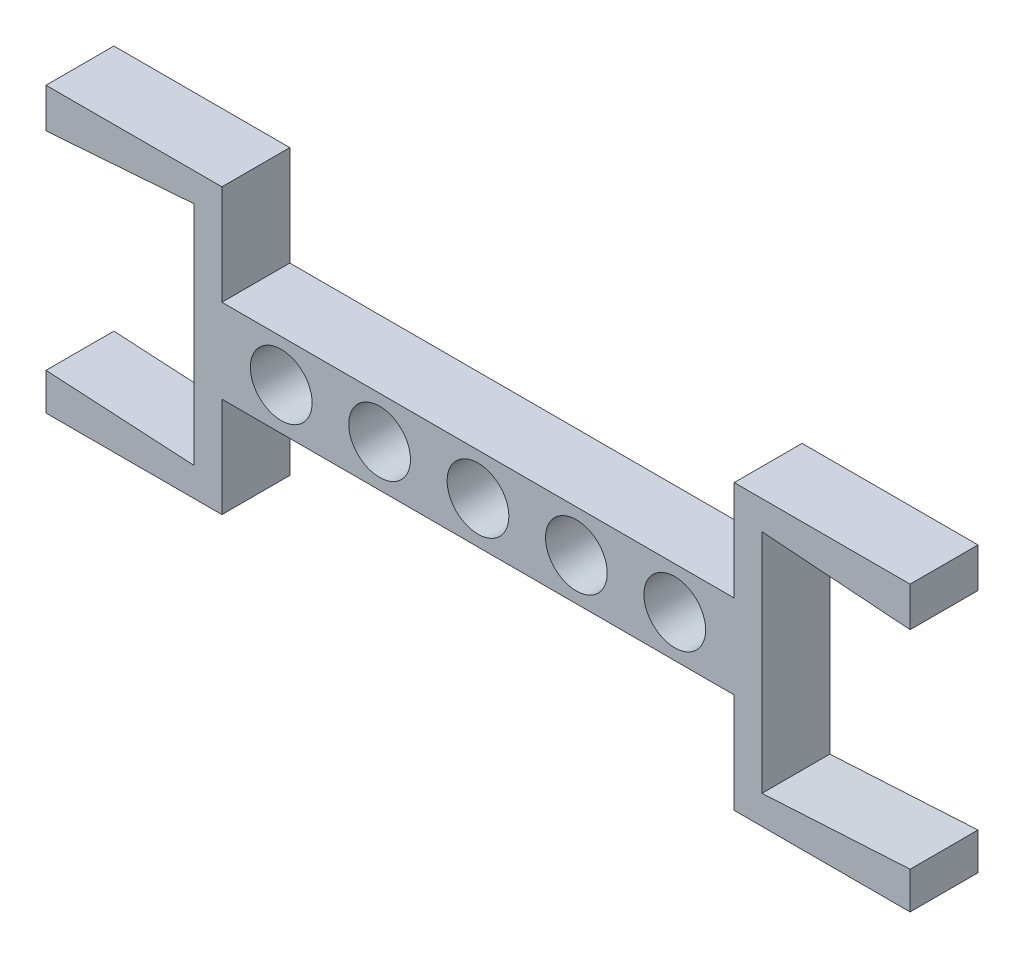
ISO-10303-21;
HEADER;
FILE_DESCRIPTION(('STEP AP214'),'2;1');
FILE_NAME('part.step','',(''),(''),'','','');
FILE_SCHEMA(('AUTOMOTIVE_DESIGN { 1 0 10303 214 1 1 1 1 }'));
ENDSEC;
DATA;
#1=APPLICATION_CONTEXT('core data for automotive mechanical design processes');
#2=APPLICATION_PROTOCOL_DEFINITION('international standard','automotive_design',2000,#1);
#3=PRODUCT_CONTEXT('',#1,'mechanical');
#4=PRODUCT('Part','Part','',(#3));
#5=PRODUCT_RELATED_PRODUCT_CATEGORY('part','',(#4));
#6=PRODUCT_DEFINITION_FORMATION('','',#4);
#7=PRODUCT_DEFINITION_CONTEXT('part definition',#1,'design');
#8=PRODUCT_DEFINITION('design','',#6,#7);
#9=PRODUCT_DEFINITION_SHAPE('','',#8);
#10=(LENGTH_UNIT() NAMED_UNIT(*) SI_UNIT(.MILLI.,.METRE.));
#11=(NAMED_UNIT(*) PLANE_ANGLE_UNIT() SI_UNIT($,.RADIAN.));
#12=(NAMED_UNIT(*) SI_UNIT($,.STERADIAN.) SOLID_ANGLE_UNIT());
#13=UNCERTAINTY_MEASURE_WITH_UNIT(LENGTH_MEASURE(1.E-05),#10,'distance_accuracy_value','');
#14=(GEOMETRIC_REPRESENTATION_CONTEXT(3) GLOBAL_UNCERTAINTY_ASSIGNED_CONTEXT((#13)) GLOBAL_UNIT_ASSIGNED_CONTEXT((#10,
#11,#12)) REPRESENTATION_CONTEXT('',''));
#15=CARTESIAN_POINT('',(0.,0.,0.));
#16=DIRECTION('',(0.,0.,1.));
#17=DIRECTION('',(1.,0.,0.));
#18=AXIS2_PLACEMENT_3D('',#15,#16,#17);
#19=CARTESIAN_POINT('',(0.,-33.6920523654957,5.5));
#20=DIRECTION('',(0.,-1.,0.));
#21=DIRECTION('',(0.,0.,-1.));
#22=AXIS2_PLACEMENT_3D('',#19,#20,#21);
#23=PLANE('',#22);
#24=DIRECTION('',(-1.,0.,0.));
#25=VECTOR('',#24,1.);
#26=CARTESIAN_POINT('',(0.,-33.6920523654957,0.));
#27=LINE('',#26,#25);
#28=CARTESIAN_POINT('',(-15.2191397554439,-33.6920523654957,0.));
#29=VERTEX_POINT('',#28);
#30=CARTESIAN_POINT('',(-29.4691397554439,-33.6920523654957,0.));
#31=VERTEX_POINT('',#30);
#32=EDGE_CURVE('E309',#29,#31,#27,.T.);
#33=ORIENTED_EDGE('',*,*,#32,.T.);
#34=DIRECTION('',(0.,0.,-1.));
#35=VECTOR('',#34,1.);
#36=CARTESIAN_POINT('',(-29.4691397554439,-33.6920523654957,5.5));
#37=LINE('',#36,#35);
#38=CARTESIAN_POINT('',(-29.4691397554439,-33.6920523654957,5.5));
#39=VERTEX_POINT('',#38);
#40=EDGE_CURVE('E121',#39,#31,#37,.T.);
#41=ORIENTED_EDGE('',*,*,#40,.F.);
#42=DIRECTION('',(-1.,0.,0.));
#43=VECTOR('',#42,1.);
#44=CARTESIAN_POINT('',(0.,-33.6920523654957,5.5));
#45=LINE('',#44,#43);
#46=CARTESIAN_POINT('',(-15.2191397554439,-33.6920523654957,5.5));
#47=VERTEX_POINT('',#46);
#48=EDGE_CURVE('E373',#47,#39,#45,.T.);
#49=ORIENTED_EDGE('',*,*,#48,.F.);
#50=DIRECTION('',(0.,0.,-1.));
#51=VECTOR('',#50,1.);
#52=CARTESIAN_POINT('',(-15.2191397554439,-33.6920523654957,5.5));
#53=LINE('',#52,#51);
#54=EDGE_CURVE('E12',#47,#29,#53,.T.);
#55=ORIENTED_EDGE('',*,*,#54,.T.);
#56=EDGE_LOOP('',(#33,#41,#49,#55));
#57=FACE_BOUND('',#56,.T.);
#58=ADVANCED_FACE('F111',(#57),#23,.F.);
#59=CARTESIAN_POINT('',(-29.4691397554438,1.36322156134959E-13,5.5));
#60=DIRECTION('',(-1.,0.,0.));
#61=DIRECTION('',(0.,-1.,0.));
#62=AXIS2_PLACEMENT_3D('',#59,#60,#61);
#63=PLANE('',#62);
#64=DIRECTION('',(0.,1.,0.));
#65=VECTOR('',#64,1.);
#66=CARTESIAN_POINT('',(-29.4691397554438,1.36322156134959E-13,0.));
#67=LINE('',#66,#65);
#68=CARTESIAN_POINT('',(-29.4691397554439,-41.7920523654957,0.));
#69=VERTEX_POINT('',#68);
#70=EDGE_CURVE('E306',#69,#31,#67,.T.);
#71=ORIENTED_EDGE('',*,*,#70,.F.);
#72=DIRECTION('',(0.,0.,-1.));
#73=VECTOR('',#72,1.);
#74=CARTESIAN_POINT('',(-29.4691397554439,-41.7920523654957,5.5));
#75=LINE('',#74,#73);
#76=CARTESIAN_POINT('',(-29.4691397554439,-41.7920523654957,5.5));
#77=VERTEX_POINT('',#76);
#78=EDGE_CURVE('E233',#77,#69,#75,.T.);
#79=ORIENTED_EDGE('',*,*,#78,.F.);
#80=DIRECTION('',(0.,1.,0.));
#81=VECTOR('',#80,1.);
#82=CARTESIAN_POINT('',(-29.4691397554438,1.36322156134959E-13,5.5));
#83=LINE('',#82,#81);
#84=EDGE_CURVE('E370',#77,#39,#83,.T.);
#85=ORIENTED_EDGE('',*,*,#84,.T.);
#86=ORIENTED_EDGE('',*,*,#40,.T.);
#87=EDGE_LOOP('',(#71,#79,#85,#86));
#88=FACE_BOUND('',#87,.T.);
#89=ADVANCED_FACE('F427',(#88),#63,.T.);
#90=CARTESIAN_POINT('',(0.,-41.7920523654957,5.5));
#91=DIRECTION('',(0.,1.,0.));
#92=DIRECTION('',(0.,0.,1.));
#93=AXIS2_PLACEMENT_3D('',#90,#91,#92);
#94=PLANE('',#93);
#95=DIRECTION('',(1.,0.,0.));
#96=VECTOR('',#95,1.);
#97=CARTESIAN_POINT('',(0.,-41.7920523654957,0.));
#98=LINE('',#97,#96);
#99=CARTESIAN_POINT('',(-70.969139755444,-41.7920523654957,0.));
#100=VERTEX_POINT('',#99);
#101=EDGE_CURVE('E303',#100,#69,#98,.T.);
#102=ORIENTED_EDGE('',*,*,#101,.F.);
#103=DIRECTION('',(0.,0.,-1.));
#104=VECTOR('',#103,1.);
#105=CARTESIAN_POINT('',(-70.969139755444,-41.7920523654957,5.5));
#106=LINE('',#105,#104);
#107=CARTESIAN_POINT('',(-70.969139755444,-41.7920523654957,5.5));
#108=VERTEX_POINT('',#107);
#109=EDGE_CURVE('E235',#108,#100,#106,.T.);
#110=ORIENTED_EDGE('',*,*,#109,.F.);
#111=DIRECTION('',(1.,0.,0.));
#112=VECTOR('',#111,1.);
#113=CARTESIAN_POINT('',(0.,-41.7920523654957,5.5));
#114=LINE('',#113,#112);
#115=EDGE_CURVE('E367',#108,#77,#114,.T.);
#116=ORIENTED_EDGE('',*,*,#115,.T.);
#117=ORIENTED_EDGE('',*,*,#78,.T.);
#118=EDGE_LOOP('',(#102,#110,#116,#117));
#119=FACE_BOUND('',#118,.T.);
#120=ADVANCED_FACE('F434',(#119),#94,.T.);
#121=CARTESIAN_POINT('',(-70.969139755444,0.,5.5));
#122=DIRECTION('',(1.,0.,0.));
#123=DIRECTION('',(0.,0.,-1.));
#124=AXIS2_PLACEMENT_3D('',#121,#122,#123);
#125=PLANE('',#124);
#126=DIRECTION('',(0.,-1.,0.));
#127=VECTOR('',#126,1.);
#128=CARTESIAN_POINT('',(-70.969139755444,0.,0.));
#129=LINE('',#128,#127);
#130=CARTESIAN_POINT('',(-70.969139755444,-33.6920523654957,0.));
#131=VERTEX_POINT('',#130);
#132=EDGE_CURVE('E200',#131,#100,#129,.T.);
#133=ORIENTED_EDGE('',*,*,#132,.F.);
#134=DIRECTION('',(0.,0.,-1.));
#135=VECTOR('',#134,1.);
#136=CARTESIAN_POINT('',(-70.969139755444,-33.6920523654957,5.5));
#137=LINE('',#136,#135);
#138=CARTESIAN_POINT('',(-70.969139755444,-33.6920523654957,5.5));
#139=VERTEX_POINT('',#138);
#140=EDGE_CURVE('E115',#139,#131,#137,.T.);
#141=ORIENTED_EDGE('',*,*,#140,.F.);
#142=DIRECTION('',(0.,-1.,0.));
#143=VECTOR('',#142,1.);
#144=CARTESIAN_POINT('',(-70.969139755444,0.,5.5));
#145=LINE('',#144,#143);
#146=EDGE_CURVE('E364',#139,#108,#145,.T.);
#147=ORIENTED_EDGE('',*,*,#146,.T.);
#148=ORIENTED_EDGE('',*,*,#109,.T.);
#149=EDGE_LOOP('',(#133,#141,#147,#148));
#150=FACE_BOUND('',#149,.T.);
#151=ADVANCED_FACE('F437',(#150),#125,.T.);
#152=CARTESIAN_POINT('',(-85.219139755444,0.,5.5));
#153=DIRECTION('',(1.,0.,0.));
#154=DIRECTION('',(0.,0.,-1.));
#155=AXIS2_PLACEMENT_3D('',#152,#153,#154);
#156=PLANE('',#155);
#157=DIRECTION('',(0.,-1.,0.));
#158=VECTOR('',#157,1.);
#159=CARTESIAN_POINT('',(-85.219139755444,0.,0.));
#160=LINE('',#159,#158);
#161=CARTESIAN_POINT('',(-85.219139755444,-33.6920523654957,0.));
#162=VERTEX_POINT('',#161);
#163=CARTESIAN_POINT('',(-85.219139755444,-36.8920523654957,0.));
#164=VERTEX_POINT('',#163);
#165=EDGE_CURVE('E206',#162,#164,#160,.T.);
#166=ORIENTED_EDGE('',*,*,#165,.T.);
#167=DIRECTION('',(0.,0.,-1.));
#168=VECTOR('',#167,1.);
#169=CARTESIAN_POINT('',(-85.219139755444,-36.8920523654957,5.5));
#170=LINE('',#169,#168);
#171=CARTESIAN_POINT('',(-85.219139755444,-36.8920523654957,5.5));
#172=VERTEX_POINT('',#171);
#173=EDGE_CURVE('E237',#172,#164,#170,.T.);
#174=ORIENTED_EDGE('',*,*,#173,.F.);
#175=DIRECTION('',(0.,-1.,0.));
#176=VECTOR('',#175,1.);
#177=CARTESIAN_POINT('',(-85.219139755444,0.,5.5));
#178=LINE('',#177,#176);
#179=CARTESIAN_POINT('',(-85.219139755444,-33.6920523654957,5.5));
#180=VERTEX_POINT('',#179);
#181=EDGE_CURVE('E223',#180,#172,#178,.T.);
#182=ORIENTED_EDGE('',*,*,#181,.F.);
#183=DIRECTION('',(0.,0.,-1.));
#184=VECTOR('',#183,1.);
#185=CARTESIAN_POINT('',(-85.219139755444,-33.6920523654957,5.5));
#186=LINE('',#185,#184);
#187=EDGE_CURVE('E220',#180,#162,#186,.T.);
#188=ORIENTED_EDGE('',*,*,#187,.T.);
#189=EDGE_LOOP('',(#166,#174,#182,#188));
#190=FACE_BOUND('',#189,.T.);
#191=ADVANCED_FACE('F221',(#190),#156,.F.);
#192=CARTESIAN_POINT('',(2.22997388961368,-30.4978576550296,5.5));
#193=DIRECTION('',(-0.0729243526956675,0.99733747487193,0.));
#194=DIRECTION('',(-0.99733747487193,-0.0729243526956675,0.));
#195=AXIS2_PLACEMENT_3D('',#192,#193,#194);
#196=PLANE('',#195);
#197=DIRECTION('',(0.99733747487193,0.0729243526956675,0.));
#198=VECTOR('',#197,1.);
#199=CARTESIAN_POINT('',(2.22997388961368,-30.4978576550296,0.));
#200=LINE('',#199,#198);
#201=CARTESIAN_POINT('',(-73.2163421258765,-36.0144193979932,0.));
#202=VERTEX_POINT('',#201);
#203=EDGE_CURVE('E213',#164,#202,#200,.T.);
#204=ORIENTED_EDGE('',*,*,#203,.T.);
#205=DIRECTION('',(0.,0.,-1.));
#206=VECTOR('',#205,1.);
#207=CARTESIAN_POINT('',(-73.2163421258765,-36.0144193979932,5.5));
#208=LINE('',#207,#206);
#209=CARTESIAN_POINT('',(-73.2163421258765,-36.0144193979932,5.5));
#210=VERTEX_POINT('',#209);
#211=EDGE_CURVE('E239',#210,#202,#208,.T.);
#212=ORIENTED_EDGE('',*,*,#211,.F.);
#213=DIRECTION('',(0.99733747487193,0.0729243526956675,0.));
#214=VECTOR('',#213,1.);
#215=CARTESIAN_POINT('',(2.22997388961368,-30.4978576550296,5.5));
#216=LINE('',#215,#214);
#217=EDGE_CURVE('E360',#172,#210,#216,.T.);
#218=ORIENTED_EDGE('',*,*,#217,.F.);
#219=ORIENTED_EDGE('',*,*,#173,.T.);
#220=EDGE_LOOP('',(#204,#212,#218,#219));
#221=FACE_BOUND('',#220,.T.);
#222=ADVANCED_FACE('F443',(#221),#196,.F.);
#223=CARTESIAN_POINT('',(-73.2163421258765,0.,5.5));
#224=DIRECTION('',(1.,0.,0.));
#225=DIRECTION('',(0.,0.,-1.));
#226=AXIS2_PLACEMENT_3D('',#223,#224,#225);
#227=PLANE('',#226);
#228=DIRECTION('',(0.,-1.,0.));
#229=VECTOR('',#228,1.);
#230=CARTESIAN_POINT('',(-73.2163421258765,0.,0.));
#231=LINE('',#230,#229);
#232=CARTESIAN_POINT('',(-73.2163421258765,-54.3696853329982,0.));
#233=VERTEX_POINT('',#232);
#234=EDGE_CURVE('E298',#202,#233,#231,.T.);
#235=ORIENTED_EDGE('',*,*,#234,.T.);
#236=DIRECTION('',(0.,0.,-1.));
#237=VECTOR('',#236,1.);
#238=CARTESIAN_POINT('',(-73.2163421258765,-54.3696853329982,5.5));
#239=LINE('',#238,#237);
#240=CARTESIAN_POINT('',(-73.2163421258765,-54.3696853329982,5.5));
#241=VERTEX_POINT('',#240);
#242=EDGE_CURVE('E242',#241,#233,#239,.T.);
#243=ORIENTED_EDGE('',*,*,#242,.F.);
#244=DIRECTION('',(0.,-1.,0.));
#245=VECTOR('',#244,1.);
#246=CARTESIAN_POINT('',(-73.2163421258765,0.,5.5));
#247=LINE('',#246,#245);
#248=EDGE_CURVE('E357',#210,#241,#247,.T.);
#249=ORIENTED_EDGE('',*,*,#248,.F.);
#250=ORIENTED_EDGE('',*,*,#211,.T.);
#251=EDGE_LOOP('',(#235,#243,#249,#250));
#252=FACE_BOUND('',#251,.T.);
#253=ADVANCED_FACE('F448',(#252),#227,.F.);
#254=CARTESIAN_POINT('',(-3.29237789325316,-58.3173302775208,5.5));
#255=DIRECTION('',(0.0563664947485583,0.998410145315922,0.));
#256=DIRECTION('',(-0.998410145315922,0.0563664947485583,0.));
#257=AXIS2_PLACEMENT_3D('',#254,#255,#256);
#258=PLANE('',#257);
#259=DIRECTION('',(0.998410145315922,-0.0563664947485583,0.));
#260=VECTOR('',#259,1.);
#261=CARTESIAN_POINT('',(-3.29237789325316,-58.3173302775208,0.));
#262=LINE('',#261,#260);
#263=CARTESIAN_POINT('',(-85.219139755444,-53.6920523654957,0.));
#264=VERTEX_POINT('',#263);
#265=EDGE_CURVE('E295',#264,#233,#262,.T.);
#266=ORIENTED_EDGE('',*,*,#265,.F.);
#267=DIRECTION('',(0.,0.,-1.));
#268=VECTOR('',#267,1.);
#269=CARTESIAN_POINT('',(-85.219139755444,-53.6920523654957,5.5));
#270=LINE('',#269,#268);
#271=CARTESIAN_POINT('',(-85.219139755444,-53.6920523654957,5.5));
#272=VERTEX_POINT('',#271);
#273=EDGE_CURVE('E244',#272,#264,#270,.T.);
#274=ORIENTED_EDGE('',*,*,#273,.F.);
#275=DIRECTION('',(0.998410145315922,-0.0563664947485583,0.));
#276=VECTOR('',#275,1.);
#277=CARTESIAN_POINT('',(-3.29237789325316,-58.3173302775208,5.5));
#278=LINE('',#277,#276);
#279=EDGE_CURVE('E354',#272,#241,#278,.T.);
#280=ORIENTED_EDGE('',*,*,#279,.T.);
#281=ORIENTED_EDGE('',*,*,#242,.T.);
#282=EDGE_LOOP('',(#266,#274,#280,#281));
#283=FACE_BOUND('',#282,.T.);
#284=ADVANCED_FACE('F515',(#283),#258,.T.);
#285=CARTESIAN_POINT('',(-85.219139755444,-56.6920523654957,0.));
#286=VERTEX_POINT('',#285);
#287=EDGE_CURVE('E218',#264,#286,#160,.T.);
#288=ORIENTED_EDGE('',*,*,#287,.T.);
#289=DIRECTION('',(0.,0.,-1.));
#290=VECTOR('',#289,1.);
#291=CARTESIAN_POINT('',(-85.219139755444,-56.6920523654957,5.5));
#292=LINE('',#291,#290);
#293=CARTESIAN_POINT('',(-85.219139755444,-56.6920523654957,5.5));
#294=VERTEX_POINT('',#293);
#295=EDGE_CURVE('E246',#294,#286,#292,.T.);
#296=ORIENTED_EDGE('',*,*,#295,.F.);
#297=EDGE_CURVE('E353',#272,#294,#178,.T.);
#298=ORIENTED_EDGE('',*,*,#297,.F.);
#299=ORIENTED_EDGE('',*,*,#273,.T.);
#300=EDGE_LOOP('',(#288,#296,#298,#299));
#301=FACE_BOUND('',#300,.T.);
#302=ADVANCED_FACE('F513',(#301),#156,.F.);
#303=CARTESIAN_POINT('',(0.,-56.6920523654957,5.5));
#304=DIRECTION('',(0.,1.,0.));
#305=DIRECTION('',(0.,0.,1.));
#306=AXIS2_PLACEMENT_3D('',#303,#304,#305);
#307=PLANE('',#306);
#308=DIRECTION('',(1.,0.,0.));
#309=VECTOR('',#308,1.);
#310=CARTESIAN_POINT('',(0.,-56.6920523654957,0.));
#311=LINE('',#310,#309);
#312=CARTESIAN_POINT('',(-70.969139755444,-56.6920523654957,0.));
#313=VERTEX_POINT('',#312);
#314=EDGE_CURVE('E292',#286,#313,#311,.T.);
#315=ORIENTED_EDGE('',*,*,#314,.T.);
#316=DIRECTION('',(0.,0.,-1.));
#317=VECTOR('',#316,1.);
#318=CARTESIAN_POINT('',(-70.969139755444,-56.6920523654957,5.5));
#319=LINE('',#318,#317);
#320=CARTESIAN_POINT('',(-70.969139755444,-56.6920523654957,5.5));
#321=VERTEX_POINT('',#320);
#322=EDGE_CURVE('E249',#321,#313,#319,.T.);
#323=ORIENTED_EDGE('',*,*,#322,.F.);
#324=DIRECTION('',(1.,0.,0.));
#325=VECTOR('',#324,1.);
#326=CARTESIAN_POINT('',(0.,-56.6920523654957,5.5));
#327=LINE('',#326,#325);
#328=EDGE_CURVE('E350',#294,#321,#327,.T.);
#329=ORIENTED_EDGE('',*,*,#328,.F.);
#330=ORIENTED_EDGE('',*,*,#295,.T.);
#331=EDGE_LOOP('',(#315,#323,#329,#330));
#332=FACE_BOUND('',#331,.T.);
#333=ADVANCED_FACE('F510',(#332),#307,.F.);
#334=CARTESIAN_POINT('',(-70.969139755444,0.,5.5));
#335=DIRECTION('',(1.,0.,0.));
#336=DIRECTION('',(0.,0.,-1.));
#337=AXIS2_PLACEMENT_3D('',#334,#335,#336);
#338=PLANE('',#337);
#339=DIRECTION('',(0.,-1.,0.));
#340=VECTOR('',#339,1.);
#341=CARTESIAN_POINT('',(-70.969139755444,0.,0.));
#342=LINE('',#341,#340);
#343=CARTESIAN_POINT('',(-70.969139755444,-48.5920523654957,0.));
#344=VERTEX_POINT('',#343);
#345=EDGE_CURVE('E289',#344,#313,#342,.T.);
#346=ORIENTED_EDGE('',*,*,#345,.F.);
#347=DIRECTION('',(0.,0.,-1.));
#348=VECTOR('',#347,1.);
#349=CARTESIAN_POINT('',(-70.969139755444,-48.5920523654957,5.5));
#350=LINE('',#349,#348);
#351=CARTESIAN_POINT('',(-70.969139755444,-48.5920523654957,5.5));
#352=VERTEX_POINT('',#351);
#353=EDGE_CURVE('E251',#352,#344,#350,.T.);
#354=ORIENTED_EDGE('',*,*,#353,.F.);
#355=DIRECTION('',(0.,-1.,0.));
#356=VECTOR('',#355,1.);
#357=CARTESIAN_POINT('',(-70.969139755444,0.,5.5));
#358=LINE('',#357,#356);
#359=EDGE_CURVE('E347',#352,#321,#358,.T.);
#360=ORIENTED_EDGE('',*,*,#359,.T.);
#361=ORIENTED_EDGE('',*,*,#322,.T.);
#362=EDGE_LOOP('',(#346,#354,#360,#361));
#363=FACE_BOUND('',#362,.T.);
#364=ADVANCED_FACE('F503',(#363),#338,.T.);
#365=CARTESIAN_POINT('',(0.,-48.5920523654957,5.5));
#366=DIRECTION('',(0.,-1.,0.));
#367=DIRECTION('',(0.,0.,-1.));
#368=AXIS2_PLACEMENT_3D('',#365,#366,#367);
#369=PLANE('',#368);
#370=DIRECTION('',(-1.,0.,0.));
#371=VECTOR('',#370,1.);
#372=CARTESIAN_POINT('',(0.,-48.5920523654957,0.));
#373=LINE('',#372,#371);
#374=CARTESIAN_POINT('',(-29.4691397554439,-48.5920523654957,0.));
#375=VERTEX_POINT('',#374);
#376=EDGE_CURVE('E286',#375,#344,#373,.T.);
#377=ORIENTED_EDGE('',*,*,#376,.F.);
#378=DIRECTION('',(0.,0.,-1.));
#379=VECTOR('',#378,1.);
#380=CARTESIAN_POINT('',(-29.4691397554439,-48.5920523654957,5.5));
#381=LINE('',#380,#379);
#382=CARTESIAN_POINT('',(-29.4691397554439,-48.5920523654957,5.5));
#383=VERTEX_POINT('',#382);
#384=EDGE_CURVE('E253',#383,#375,#381,.T.);
#385=ORIENTED_EDGE('',*,*,#384,.F.);
#386=DIRECTION('',(-1.,0.,0.));
#387=VECTOR('',#386,1.);
#388=CARTESIAN_POINT('',(0.,-48.5920523654957,5.5));
#389=LINE('',#388,#387);
#390=EDGE_CURVE('E344',#383,#352,#389,.T.);
#391=ORIENTED_EDGE('',*,*,#390,.T.);
#392=ORIENTED_EDGE('',*,*,#353,.T.);
#393=EDGE_LOOP('',(#377,#385,#391,#392));
#394=FACE_BOUND('',#393,.T.);
#395=ADVANCED_FACE('F497',(#394),#369,.T.);
#396=CARTESIAN_POINT('',(-29.4691397554439,0.,5.5));
#397=DIRECTION('',(1.,0.,0.));
#398=DIRECTION('',(0.,0.,-1.));
#399=AXIS2_PLACEMENT_3D('',#396,#397,#398);
#400=PLANE('',#399);
#401=DIRECTION('',(0.,-1.,0.));
#402=VECTOR('',#401,1.);
#403=CARTESIAN_POINT('',(-29.4691397554439,0.,0.));
#404=LINE('',#403,#402);
#405=CARTESIAN_POINT('',(-29.4691397554439,-56.6920523654957,0.));
#406=VERTEX_POINT('',#405);
#407=EDGE_CURVE('E283',#375,#406,#404,.T.);
#408=ORIENTED_EDGE('',*,*,#407,.T.);
#409=DIRECTION('',(0.,0.,-1.));
#410=VECTOR('',#409,1.);
#411=CARTESIAN_POINT('',(-29.4691397554439,-56.6920523654957,5.5));
#412=LINE('',#411,#410);
#413=CARTESIAN_POINT('',(-29.4691397554439,-56.6920523654957,5.5));
#414=VERTEX_POINT('',#413);
#415=EDGE_CURVE('E255',#414,#406,#412,.T.);
#416=ORIENTED_EDGE('',*,*,#415,.F.);
#417=DIRECTION('',(0.,-1.,0.));
#418=VECTOR('',#417,1.);
#419=CARTESIAN_POINT('',(-29.4691397554439,0.,5.5));
#420=LINE('',#419,#418);
#421=EDGE_CURVE('E341',#383,#414,#420,.T.);
#422=ORIENTED_EDGE('',*,*,#421,.F.);
#423=ORIENTED_EDGE('',*,*,#384,.T.);
#424=EDGE_LOOP('',(#408,#416,#422,#423));
#425=FACE_BOUND('',#424,.T.);
#426=ADVANCED_FACE('F569',(#425),#400,.F.);
#427=CARTESIAN_POINT('',(0.,-56.6920523654957,5.5));
#428=DIRECTION('',(0.,-1.,0.));
#429=DIRECTION('',(0.,0.,-1.));
#430=AXIS2_PLACEMENT_3D('',#427,#428,#429);
#431=PLANE('',#430);
#432=DIRECTION('',(-1.,0.,0.));
#433=VECTOR('',#432,1.);
#434=CARTESIAN_POINT('',(0.,-56.6920523654957,0.));
#435=LINE('',#434,#433);
#436=CARTESIAN_POINT('',(-15.2191397554439,-56.6920523654957,0.));
#437=VERTEX_POINT('',#436);
#438=EDGE_CURVE('E280',#437,#406,#435,.T.);
#439=ORIENTED_EDGE('',*,*,#438,.F.);
#440=DIRECTION('',(0.,0.,-1.));
#441=VECTOR('',#440,1.);
#442=CARTESIAN_POINT('',(-15.2191397554439,-56.6920523654957,5.5));
#443=LINE('',#442,#441);
#444=CARTESIAN_POINT('',(-15.2191397554439,-56.6920523654957,5.5));
#445=VERTEX_POINT('',#444);
#446=EDGE_CURVE('E257',#445,#437,#443,.T.);
#447=ORIENTED_EDGE('',*,*,#446,.F.);
#448=DIRECTION('',(-1.,0.,0.));
#449=VECTOR('',#448,1.);
#450=CARTESIAN_POINT('',(0.,-56.6920523654957,5.5));
#451=LINE('',#450,#449);
#452=EDGE_CURVE('E338',#445,#414,#451,.T.);
#453=ORIENTED_EDGE('',*,*,#452,.T.);
#454=ORIENTED_EDGE('',*,*,#415,.T.);
#455=EDGE_LOOP('',(#439,#447,#453,#454));
#456=FACE_BOUND('',#455,.T.);
#457=ADVANCED_FACE('F491',(#456),#431,.T.);
#458=CARTESIAN_POINT('',(-15.2191397554439,0.,5.5));
#459=DIRECTION('',(1.,0.,0.));
#460=DIRECTION('',(0.,0.,-1.));
#461=AXIS2_PLACEMENT_3D('',#458,#459,#460);
#462=PLANE('',#461);
#463=DIRECTION('',(0.,-1.,0.));
#464=VECTOR('',#463,1.);
#465=CARTESIAN_POINT('',(-15.2191397554439,0.,0.));
#466=LINE('',#465,#464);
#467=CARTESIAN_POINT('',(-15.219139755444,-53.6920523654957,0.));
#468=VERTEX_POINT('',#467);
#469=EDGE_CURVE('E277',#468,#437,#466,.T.);
#470=ORIENTED_EDGE('',*,*,#469,.F.);
#471=DIRECTION('',(0.,0.,-1.));
#472=VECTOR('',#471,1.);
#473=CARTESIAN_POINT('',(-15.219139755444,-53.6920523654957,5.5));
#474=LINE('',#473,#472);
#475=CARTESIAN_POINT('',(-15.219139755444,-53.6920523654957,5.5));
#476=VERTEX_POINT('',#475);
#477=EDGE_CURVE('E259',#476,#468,#474,.T.);
#478=ORIENTED_EDGE('',*,*,#477,.F.);
#479=DIRECTION('',(0.,-1.,0.));
#480=VECTOR('',#479,1.);
#481=CARTESIAN_POINT('',(-15.2191397554439,0.,5.5));
#482=LINE('',#481,#480);
#483=EDGE_CURVE('E335',#476,#445,#482,.T.);
#484=ORIENTED_EDGE('',*,*,#483,.T.);
#485=ORIENTED_EDGE('',*,*,#446,.T.);
#486=EDGE_LOOP('',(#470,#478,#484,#485));
#487=FACE_BOUND('',#486,.T.);
#488=ADVANCED_FACE('F488',(#487),#462,.T.);
#489=CARTESIAN_POINT('',(2.9732672265745,-52.6649772527011,5.5));
#490=DIRECTION('',(0.0563664947485583,-0.998410145315922,0.));
#491=DIRECTION('',(0.998410145315922,0.0563664947485583,0.));
#492=AXIS2_PLACEMENT_3D('',#489,#490,#491);
#493=PLANE('',#492);
#494=DIRECTION('',(-0.998410145315922,-0.0563664947485583,0.));
#495=VECTOR('',#494,1.);
#496=CARTESIAN_POINT('',(2.9732672265745,-52.6649772527011,0.));
#497=LINE('',#496,#495);
#498=CARTESIAN_POINT('',(-27.2219373850114,-54.3696853329982,0.));
#499=VERTEX_POINT('',#498);
#500=EDGE_CURVE('E274',#468,#499,#497,.T.);
#501=ORIENTED_EDGE('',*,*,#500,.T.);
#502=DIRECTION('',(0.,0.,-1.));
#503=VECTOR('',#502,1.);
#504=CARTESIAN_POINT('',(-27.2219373850114,-54.3696853329982,5.5));
#505=LINE('',#504,#503);
#506=CARTESIAN_POINT('',(-27.2219373850114,-54.3696853329982,5.5));
#507=VERTEX_POINT('',#506);
#508=EDGE_CURVE('E261',#507,#499,#505,.T.);
#509=ORIENTED_EDGE('',*,*,#508,.F.);
#510=DIRECTION('',(-0.998410145315922,-0.0563664947485583,0.));
#511=VECTOR('',#510,1.);
#512=CARTESIAN_POINT('',(2.9732672265745,-52.6649772527011,5.5));
#513=LINE('',#512,#511);
#514=EDGE_CURVE('E332',#476,#507,#513,.T.);
#515=ORIENTED_EDGE('',*,*,#514,.F.);
#516=ORIENTED_EDGE('',*,*,#477,.T.);
#517=EDGE_LOOP('',(#501,#509,#515,#516));
#518=FACE_BOUND('',#517,.T.);
#519=ADVANCED_FACE('F480',(#518),#493,.F.);
#520=CARTESIAN_POINT('',(-27.2219373850114,0.,5.5));
#521=DIRECTION('',(1.,0.,0.));
#522=DIRECTION('',(0.,0.,-1.));
#523=AXIS2_PLACEMENT_3D('',#520,#521,#522);
#524=PLANE('',#523);
#525=DIRECTION('',(0.,-1.,0.));
#526=VECTOR('',#525,1.);
#527=CARTESIAN_POINT('',(-27.2219373850114,0.,0.));
#528=LINE('',#527,#526);
#529=CARTESIAN_POINT('',(-27.2219373850114,-36.0144193979932,0.));
#530=VERTEX_POINT('',#529);
#531=EDGE_CURVE('E271',#530,#499,#528,.T.);
#532=ORIENTED_EDGE('',*,*,#531,.F.);
#533=DIRECTION('',(0.,0.,-1.));
#534=VECTOR('',#533,1.);
#535=CARTESIAN_POINT('',(-27.2219373850114,-36.0144193979932,5.5));
#536=LINE('',#535,#534);
#537=CARTESIAN_POINT('',(-27.2219373850114,-36.0144193979932,5.5));
#538=VERTEX_POINT('',#537);
#539=EDGE_CURVE('E263',#538,#530,#536,.T.);
#540=ORIENTED_EDGE('',*,*,#539,.F.);
#541=DIRECTION('',(0.,-1.,0.));
#542=VECTOR('',#541,1.);
#543=CARTESIAN_POINT('',(-27.2219373850114,0.,5.5));
#544=LINE('',#543,#542);
#545=EDGE_CURVE('E329',#538,#507,#544,.T.);
#546=ORIENTED_EDGE('',*,*,#545,.T.);
#547=ORIENTED_EDGE('',*,*,#508,.T.);
#548=EDGE_LOOP('',(#532,#540,#546,#547));
#549=FACE_BOUND('',#548,.T.);
#550=ADVANCED_FACE('F484',(#549),#524,.T.);
#551=CARTESIAN_POINT('',(-2.76410076466259,-37.8027527844473,5.5));
#552=DIRECTION('',(-0.0729243526956675,-0.99733747487193,0.));
#553=DIRECTION('',(0.99733747487193,-0.0729243526956675,0.));
#554=AXIS2_PLACEMENT_3D('',#551,#552,#553);
#555=PLANE('',#554);
#556=DIRECTION('',(-0.99733747487193,0.0729243526956675,0.));
#557=VECTOR('',#556,1.);
#558=CARTESIAN_POINT('',(-2.76410076466259,-37.8027527844473,0.));
#559=LINE('',#558,#557);
#560=CARTESIAN_POINT('',(-15.219139755444,-36.8920523654957,0.));
#561=VERTEX_POINT('',#560);
#562=EDGE_CURVE('E267',#561,#530,#559,.T.);
#563=ORIENTED_EDGE('',*,*,#562,.F.);
#564=DIRECTION('',(0.,0.,-1.));
#565=VECTOR('',#564,1.);
#566=CARTESIAN_POINT('',(-15.219139755444,-36.8920523654957,5.5));
#567=LINE('',#566,#565);
#568=CARTESIAN_POINT('',(-15.219139755444,-36.8920523654957,5.5));
#569=VERTEX_POINT('',#568);
#570=EDGE_CURVE('E130',#569,#561,#567,.T.);
#571=ORIENTED_EDGE('',*,*,#570,.F.);
#572=DIRECTION('',(-0.99733747487193,0.0729243526956675,0.));
#573=VECTOR('',#572,1.);
#574=CARTESIAN_POINT('',(-2.76410076466259,-37.8027527844473,5.5));
#575=LINE('',#574,#573);
#576=EDGE_CURVE('E266',#569,#538,#575,.T.);
#577=ORIENTED_EDGE('',*,*,#576,.T.);
#578=ORIENTED_EDGE('',*,*,#539,.T.);
#579=EDGE_LOOP('',(#563,#571,#577,#578));
#580=FACE_BOUND('',#579,.T.);
#581=ADVANCED_FACE('F485',(#580),#555,.T.);
#582=CARTESIAN_POINT('',(-15.2191397554439,0.,5.5));
#583=DIRECTION('',(1.,0.,0.));
#584=DIRECTION('',(0.,0.,-1.));
#585=AXIS2_PLACEMENT_3D('',#582,#583,#584);
#586=PLANE('',#585);
#587=DIRECTION('',(0.,-1.,0.));
#588=VECTOR('',#587,1.);
#589=CARTESIAN_POINT('',(-15.2191397554439,0.,0.));
#590=LINE('',#589,#588);
#591=EDGE_CURVE('E312',#29,#561,#590,.T.);
#592=ORIENTED_EDGE('',*,*,#591,.F.);
#593=ORIENTED_EDGE('',*,*,#54,.F.);
#594=DIRECTION('',(0.,-1.,0.));
#595=VECTOR('',#594,1.);
#596=CARTESIAN_POINT('',(-15.2191397554439,0.,5.5));
#597=LINE('',#596,#595);
#598=EDGE_CURVE('E376',#47,#569,#597,.T.);
#599=ORIENTED_EDGE('',*,*,#598,.T.);
#600=ORIENTED_EDGE('',*,*,#570,.T.);
#601=EDGE_LOOP('',(#592,#593,#599,#600));
#602=FACE_BOUND('',#601,.T.);
#603=ADVANCED_FACE('F419',(#602),#586,.T.);
#604=CARTESIAN_POINT('',(-66.164139755444,-45.1920523654957,5.5));
#605=DIRECTION('',(0.,0.,-1.));
#606=DIRECTION('',(-1.,0.,0.));
#607=AXIS2_PLACEMENT_3D('',#604,#605,#606);
#608=CYLINDRICAL_SURFACE('',#607,2.50000000000001);
#609=CARTESIAN_POINT('',(-66.164139755444,-45.1920523654957,5.5));
#610=DIRECTION('',(0.,0.,1.));
#611=DIRECTION('',(1.,0.,0.));
#612=AXIS2_PLACEMENT_3D('',#609,#610,#611);
#613=CIRCLE('',#612,2.50000000000001);
#614=CARTESIAN_POINT('',(-63.6641397554439,-45.1920523654957,5.5));
#615=VERTEX_POINT('',#614);
#616=EDGE_CURVE('E378',#615,#615,#613,.T.);
#617=ORIENTED_EDGE('',*,*,#616,.T.);
#618=EDGE_LOOP('',(#617));
#619=FACE_BOUND('',#618,.T.);
#620=CARTESIAN_POINT('',(-66.164139755444,-45.1920523654957,0.));
#621=DIRECTION('',(0.,0.,1.));
#622=DIRECTION('',(1.,0.,0.));
#623=AXIS2_PLACEMENT_3D('',#620,#621,#622);
#624=CIRCLE('',#623,2.50000000000001);
#625=CARTESIAN_POINT('',(-63.6641397554439,-45.1920523654957,0.));
#626=VERTEX_POINT('',#625);
#627=EDGE_CURVE('E314',#626,#626,#624,.T.);
#628=ORIENTED_EDGE('',*,*,#627,.F.);
#629=EDGE_LOOP('',(#628));
#630=FACE_BOUND('',#629,.T.);
#631=ADVANCED_FACE('F534',(#619,#630),#608,.F.);
#632=CARTESIAN_POINT('',(-58.194139755444,-45.1920523654957,5.5));
#633=DIRECTION('',(0.,0.,-1.));
#634=DIRECTION('',(-1.,0.,0.));
#635=AXIS2_PLACEMENT_3D('',#632,#633,#634);
#636=CYLINDRICAL_SURFACE('',#635,2.5);
#637=CARTESIAN_POINT('',(-58.194139755444,-45.1920523654957,5.5));
#638=DIRECTION('',(0.,0.,1.));
#639=DIRECTION('',(1.,0.,0.));
#640=AXIS2_PLACEMENT_3D('',#637,#638,#639);
#641=CIRCLE('',#640,2.5);
#642=CARTESIAN_POINT('',(-55.694139755444,-45.1920523654957,5.5));
#643=VERTEX_POINT('',#642);
#644=EDGE_CURVE('E381',#643,#643,#641,.T.);
#645=ORIENTED_EDGE('',*,*,#644,.T.);
#646=EDGE_LOOP('',(#645));
#647=FACE_BOUND('',#646,.T.);
#648=CARTESIAN_POINT('',(-58.194139755444,-45.1920523654957,0.));
#649=DIRECTION('',(0.,0.,1.));
#650=DIRECTION('',(1.,0.,0.));
#651=AXIS2_PLACEMENT_3D('',#648,#649,#650);
#652=CIRCLE('',#651,2.5);
#653=CARTESIAN_POINT('',(-55.694139755444,-45.1920523654957,0.));
#654=VERTEX_POINT('',#653);
#655=EDGE_CURVE('E317',#654,#654,#652,.T.);
#656=ORIENTED_EDGE('',*,*,#655,.F.);
#657=EDGE_LOOP('',(#656));
#658=FACE_BOUND('',#657,.T.);
#659=ADVANCED_FACE('F537',(#647,#658),#636,.F.);
#660=CARTESIAN_POINT('',(-50.224139755444,-45.1920523654957,5.5));
#661=DIRECTION('',(0.,0.,-1.));
#662=DIRECTION('',(-1.,0.,0.));
#663=AXIS2_PLACEMENT_3D('',#660,#661,#662);
#664=CYLINDRICAL_SURFACE('',#663,2.5);
#665=CARTESIAN_POINT('',(-50.224139755444,-45.1920523654957,5.5));
#666=DIRECTION('',(0.,0.,1.));
#667=DIRECTION('',(1.,0.,0.));
#668=AXIS2_PLACEMENT_3D('',#665,#666,#667);
#669=CIRCLE('',#668,2.5);
#670=CARTESIAN_POINT('',(-47.724139755444,-45.1920523654957,5.5));
#671=VERTEX_POINT('',#670);
#672=EDGE_CURVE('E384',#671,#671,#669,.T.);
#673=ORIENTED_EDGE('',*,*,#672,.T.);
#674=EDGE_LOOP('',(#673));
#675=FACE_BOUND('',#674,.T.);
#676=CARTESIAN_POINT('',(-50.224139755444,-45.1920523654957,0.));
#677=DIRECTION('',(0.,0.,1.));
#678=DIRECTION('',(1.,0.,0.));
#679=AXIS2_PLACEMENT_3D('',#676,#677,#678);
#680=CIRCLE('',#679,2.5);
#681=CARTESIAN_POINT('',(-47.724139755444,-45.1920523654957,0.));
#682=VERTEX_POINT('',#681);
#683=EDGE_CURVE('E320',#682,#682,#680,.T.);
#684=ORIENTED_EDGE('',*,*,#683,.F.);
#685=EDGE_LOOP('',(#684));
#686=FACE_BOUND('',#685,.T.);
#687=ADVANCED_FACE('F541',(#675,#686),#664,.F.);
#688=CARTESIAN_POINT('',(-42.254139755444,-45.1920523654957,5.5));
#689=DIRECTION('',(0.,0.,-1.));
#690=DIRECTION('',(-1.,0.,0.));
#691=AXIS2_PLACEMENT_3D('',#688,#689,#690);
#692=CYLINDRICAL_SURFACE('',#691,2.5);
#693=CARTESIAN_POINT('',(-42.254139755444,-45.1920523654957,5.5));
#694=DIRECTION('',(0.,0.,1.));
#695=DIRECTION('',(1.,0.,0.));
#696=AXIS2_PLACEMENT_3D('',#693,#694,#695);
#697=CIRCLE('',#696,2.5);
#698=CARTESIAN_POINT('',(-39.754139755444,-45.1920523654957,5.5));
#699=VERTEX_POINT('',#698);
#700=EDGE_CURVE('E387',#699,#699,#697,.T.);
#701=ORIENTED_EDGE('',*,*,#700,.T.);
#702=EDGE_LOOP('',(#701));
#703=FACE_BOUND('',#702,.T.);
#704=CARTESIAN_POINT('',(-42.254139755444,-45.1920523654957,0.));
#705=DIRECTION('',(0.,0.,1.));
#706=DIRECTION('',(1.,0.,0.));
#707=AXIS2_PLACEMENT_3D('',#704,#705,#706);
#708=CIRCLE('',#707,2.5);
#709=CARTESIAN_POINT('',(-39.754139755444,-45.1920523654957,0.));
#710=VERTEX_POINT('',#709);
#711=EDGE_CURVE('E323',#710,#710,#708,.T.);
#712=ORIENTED_EDGE('',*,*,#711,.F.);
#713=EDGE_LOOP('',(#712));
#714=FACE_BOUND('',#713,.T.);
#715=ADVANCED_FACE('F545',(#703,#714),#692,.F.);
#716=CARTESIAN_POINT('',(-34.284139755444,-45.1920523654957,5.5));
#717=DIRECTION('',(0.,0.,-1.));
#718=DIRECTION('',(-1.,0.,0.));
#719=AXIS2_PLACEMENT_3D('',#716,#717,#718);
#720=CYLINDRICAL_SURFACE('',#719,2.5);
#721=CARTESIAN_POINT('',(-34.284139755444,-45.1920523654957,5.5));
#722=DIRECTION('',(0.,0.,1.));
#723=DIRECTION('',(1.,0.,0.));
#724=AXIS2_PLACEMENT_3D('',#721,#722,#723);
#725=CIRCLE('',#724,2.5);
#726=CARTESIAN_POINT('',(-31.784139755444,-45.1920523654957,5.5));
#727=VERTEX_POINT('',#726);
#728=EDGE_CURVE('E270',#727,#727,#725,.T.);
#729=ORIENTED_EDGE('',*,*,#728,.T.);
#730=EDGE_LOOP('',(#729));
#731=FACE_BOUND('',#730,.T.);
#732=CARTESIAN_POINT('',(-34.284139755444,-45.1920523654957,0.));
#733=DIRECTION('',(0.,0.,1.));
#734=DIRECTION('',(1.,0.,0.));
#735=AXIS2_PLACEMENT_3D('',#732,#733,#734);
#736=CIRCLE('',#735,2.5);
#737=CARTESIAN_POINT('',(-31.784139755444,-45.1920523654957,0.));
#738=VERTEX_POINT('',#737);
#739=EDGE_CURVE('E227',#738,#738,#736,.T.);
#740=ORIENTED_EDGE('',*,*,#739,.F.);
#741=EDGE_LOOP('',(#740));
#742=FACE_BOUND('',#741,.T.);
#743=ADVANCED_FACE('F393',(#731,#742),#720,.F.);
#744=CARTESIAN_POINT('',(0.,0.,0.));
#745=DIRECTION('',(0.,0.,1.));
#746=DIRECTION('',(1.,0.,0.));
#747=AXIS2_PLACEMENT_3D('',#744,#745,#746);
#748=PLANE('',#747);
#749=ORIENTED_EDGE('',*,*,#739,.T.);
#750=EDGE_LOOP('',(#749));
#751=FACE_BOUND('',#750,.T.);
#752=ORIENTED_EDGE('',*,*,#711,.T.);
#753=EDGE_LOOP('',(#752));
#754=FACE_BOUND('',#753,.T.);
#755=ORIENTED_EDGE('',*,*,#683,.T.);
#756=EDGE_LOOP('',(#755));
#757=FACE_BOUND('',#756,.T.);
#758=ORIENTED_EDGE('',*,*,#655,.T.);
#759=EDGE_LOOP('',(#758));
#760=FACE_BOUND('',#759,.T.);
#761=ORIENTED_EDGE('',*,*,#627,.T.);
#762=EDGE_LOOP('',(#761));
#763=FACE_BOUND('',#762,.T.);
#764=ORIENTED_EDGE('',*,*,#591,.T.);
#765=ORIENTED_EDGE('',*,*,#562,.T.);
#766=ORIENTED_EDGE('',*,*,#531,.T.);
#767=ORIENTED_EDGE('',*,*,#500,.F.);
#768=ORIENTED_EDGE('',*,*,#469,.T.);
#769=ORIENTED_EDGE('',*,*,#438,.T.);
#770=ORIENTED_EDGE('',*,*,#407,.F.);
#771=ORIENTED_EDGE('',*,*,#376,.T.);
#772=ORIENTED_EDGE('',*,*,#345,.T.);
#773=ORIENTED_EDGE('',*,*,#314,.F.);
#774=ORIENTED_EDGE('',*,*,#287,.F.);
#775=ORIENTED_EDGE('',*,*,#265,.T.);
#776=ORIENTED_EDGE('',*,*,#234,.F.);
#777=ORIENTED_EDGE('',*,*,#203,.F.);
#778=ORIENTED_EDGE('',*,*,#165,.F.);
#779=DIRECTION('',(1.,0.,0.));
#780=VECTOR('',#779,1.);
#781=CARTESIAN_POINT('',(-85.219139755444,-33.6920523654957,0.));
#782=LINE('',#781,#780);
#783=EDGE_CURVE('E211',#162,#131,#782,.T.);
#784=ORIENTED_EDGE('',*,*,#783,.T.);
#785=ORIENTED_EDGE('',*,*,#132,.T.);
#786=ORIENTED_EDGE('',*,*,#101,.T.);
#787=ORIENTED_EDGE('',*,*,#70,.T.);
#788=ORIENTED_EDGE('',*,*,#32,.F.);
#789=EDGE_LOOP('',(#764,#765,#766,#767,#768,#769,#770,#771,#772,#773,#774,#775,#776,#777,#778,
#784,#785,#786,#787,#788));
#790=FACE_BOUND('',#789,.T.);
#791=ADVANCED_FACE('F209',(#751,#754,#757,#760,#763,#790),#748,.F.);
#792=CARTESIAN_POINT('',(0.,0.,5.5));
#793=DIRECTION('',(0.,0.,1.));
#794=DIRECTION('',(1.,0.,0.));
#795=AXIS2_PLACEMENT_3D('',#792,#793,#794);
#796=PLANE('',#795);
#797=ORIENTED_EDGE('',*,*,#728,.F.);
#798=EDGE_LOOP('',(#797));
#799=FACE_BOUND('',#798,.T.);
#800=ORIENTED_EDGE('',*,*,#700,.F.);
#801=EDGE_LOOP('',(#800));
#802=FACE_BOUND('',#801,.T.);
#803=ORIENTED_EDGE('',*,*,#672,.F.);
#804=EDGE_LOOP('',(#803));
#805=FACE_BOUND('',#804,.T.);
#806=ORIENTED_EDGE('',*,*,#644,.F.);
#807=EDGE_LOOP('',(#806));
#808=FACE_BOUND('',#807,.T.);
#809=ORIENTED_EDGE('',*,*,#616,.F.);
#810=EDGE_LOOP('',(#809));
#811=FACE_BOUND('',#810,.T.);
#812=ORIENTED_EDGE('',*,*,#598,.F.);
#813=ORIENTED_EDGE('',*,*,#48,.T.);
#814=ORIENTED_EDGE('',*,*,#84,.F.);
#815=ORIENTED_EDGE('',*,*,#115,.F.);
#816=ORIENTED_EDGE('',*,*,#146,.F.);
#817=DIRECTION('',(1.,0.,0.));
#818=VECTOR('',#817,1.);
#819=CARTESIAN_POINT('',(-85.219139755444,-33.6920523654957,5.5));
#820=LINE('',#819,#818);
#821=EDGE_CURVE('E228',#180,#139,#820,.T.);
#822=ORIENTED_EDGE('',*,*,#821,.F.);
#823=ORIENTED_EDGE('',*,*,#181,.T.);
#824=ORIENTED_EDGE('',*,*,#217,.T.);
#825=ORIENTED_EDGE('',*,*,#248,.T.);
#826=ORIENTED_EDGE('',*,*,#279,.F.);
#827=ORIENTED_EDGE('',*,*,#297,.T.);
#828=ORIENTED_EDGE('',*,*,#328,.T.);
#829=ORIENTED_EDGE('',*,*,#359,.F.);
#830=ORIENTED_EDGE('',*,*,#390,.F.);
#831=ORIENTED_EDGE('',*,*,#421,.T.);
#832=ORIENTED_EDGE('',*,*,#452,.F.);
#833=ORIENTED_EDGE('',*,*,#483,.F.);
#834=ORIENTED_EDGE('',*,*,#514,.T.);
#835=ORIENTED_EDGE('',*,*,#545,.F.);
#836=ORIENTED_EDGE('',*,*,#576,.F.);
#837=EDGE_LOOP('',(#812,#813,#814,#815,#816,#822,#823,#824,#825,#826,#827,#828,#829,#830,#831,
#832,#833,#834,#835,#836));
#838=FACE_BOUND('',#837,.T.);
#839=ADVANCED_FACE('F396',(#799,#802,#805,#808,#811,#838),#796,.T.);
#840=CARTESIAN_POINT('',(-85.219139755444,-33.6920523654957,5.5));
#841=DIRECTION('',(0.,1.,0.));
#842=DIRECTION('',(0.,0.,1.));
#843=AXIS2_PLACEMENT_3D('',#840,#841,#842);
#844=PLANE('',#843);
#845=ORIENTED_EDGE('',*,*,#783,.F.);
#846=ORIENTED_EDGE('',*,*,#187,.F.);
#847=ORIENTED_EDGE('',*,*,#821,.T.);
#848=ORIENTED_EDGE('',*,*,#140,.T.);
#849=EDGE_LOOP('',(#845,#846,#847,#848));
#850=FACE_BOUND('',#849,.T.);
#851=ADVANCED_FACE('F113',(#850),#844,.T.);
#852=CLOSED_SHELL('',(#58,#89,#120,#151,#191,#222,#253,#284,#302,#333,#364,#395,#426,#457,#488,
#519,#550,#581,#603,#631,#659,#687,#715,#743,#791,#839,#851));
#853=MANIFOLD_SOLID_BREP('B2',#852);
#854=ADVANCED_BREP_SHAPE_REPRESENTATION('',(#18,#853),#14);
#855=SHAPE_DEFINITION_REPRESENTATION(#9,#854);
ENDSEC;
END-ISO-10303-21;
